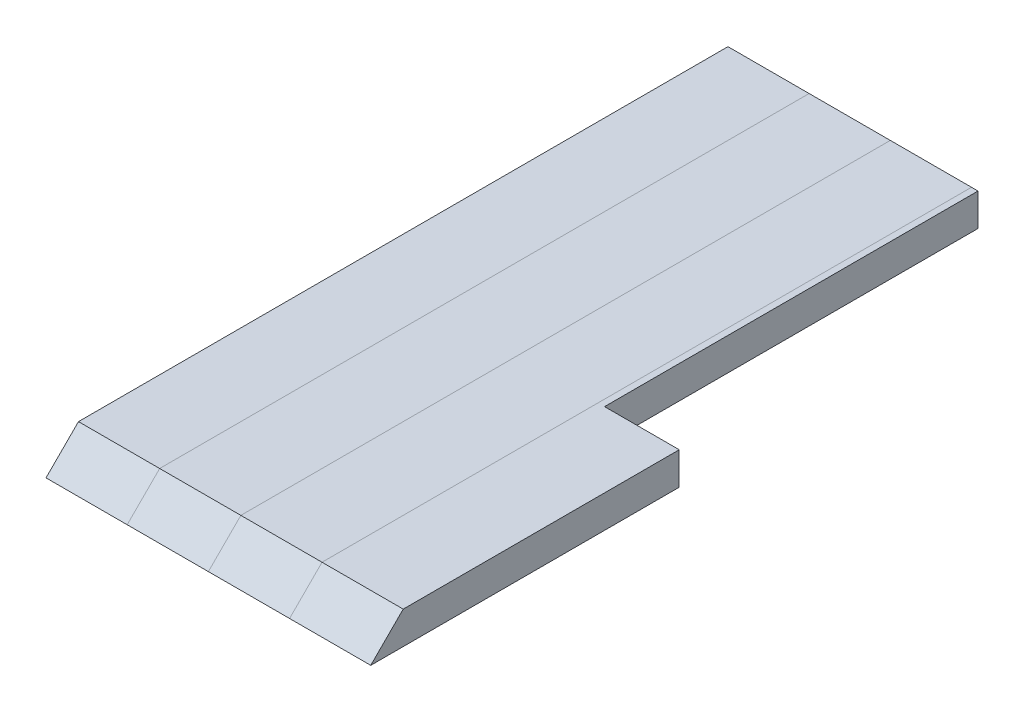
ISO-10303-21;
HEADER;
FILE_DESCRIPTION(('STEP AP214'),'2;1');
FILE_NAME('part.step','',(''),(''),'','','');
FILE_SCHEMA(('AUTOMOTIVE_DESIGN { 1 0 10303 214 1 1 1 1 }'));
ENDSEC;
DATA;
#1=APPLICATION_CONTEXT('core data for automotive mechanical design processes');
#2=APPLICATION_PROTOCOL_DEFINITION('international standard','automotive_design',2000,#1);
#3=PRODUCT_CONTEXT('',#1,'mechanical');
#4=PRODUCT('Part','Part','',(#3));
#5=PRODUCT_RELATED_PRODUCT_CATEGORY('part','',(#4));
#6=PRODUCT_DEFINITION_FORMATION('','',#4);
#7=PRODUCT_DEFINITION_CONTEXT('part definition',#1,'design');
#8=PRODUCT_DEFINITION('design','',#6,#7);
#9=PRODUCT_DEFINITION_SHAPE('','',#8);
#10=(LENGTH_UNIT() NAMED_UNIT(*) SI_UNIT(.MILLI.,.METRE.));
#11=(NAMED_UNIT(*) PLANE_ANGLE_UNIT() SI_UNIT($,.RADIAN.));
#12=(NAMED_UNIT(*) SI_UNIT($,.STERADIAN.) SOLID_ANGLE_UNIT());
#13=UNCERTAINTY_MEASURE_WITH_UNIT(LENGTH_MEASURE(1.E-05),#10,'distance_accuracy_value','');
#14=(GEOMETRIC_REPRESENTATION_CONTEXT(3) GLOBAL_UNCERTAINTY_ASSIGNED_CONTEXT((#13)) GLOBAL_UNIT_ASSIGNED_CONTEXT((#10,
#11,#12)) REPRESENTATION_CONTEXT('',''));
#15=CARTESIAN_POINT('',(0.,0.,0.));
#16=DIRECTION('',(0.,0.,1.));
#17=DIRECTION('',(1.,0.,0.));
#18=AXIS2_PLACEMENT_3D('',#15,#16,#17);
#19=CARTESIAN_POINT('',(0.,0.,0.));
#20=DIRECTION('',(0.,1.,0.));
#21=DIRECTION('',(0.,0.,1.));
#22=AXIS2_PLACEMENT_3D('',#19,#20,#21);
#23=PLANE('',#22);
#24=DIRECTION('',(1.,0.,0.));
#25=VECTOR('',#24,1.);
#26=CARTESIAN_POINT('',(12.5,0.,-105.));
#27=LINE('',#26,#25);
#28=CARTESIAN_POINT('',(12.5,0.,-105.));
#29=VERTEX_POINT('',#28);
#30=CARTESIAN_POINT('',(-12.5,0.,-105.));
#31=VERTEX_POINT('',#30);
#32=EDGE_CURVE('P0_E55',#29,#31,#27,.F.);
#33=ORIENTED_EDGE('',*,*,#32,.T.);
#34=DIRECTION('',(0.,0.,-1.));
#35=VECTOR('',#34,1.);
#36=CARTESIAN_POINT('',(-12.5,0.,-105.));
#37=LINE('',#36,#35);
#38=CARTESIAN_POINT('',(-12.5,0.,95.));
#39=VERTEX_POINT('',#38);
#40=EDGE_CURVE('P0_E76',#31,#39,#37,.F.);
#41=ORIENTED_EDGE('',*,*,#40,.T.);
#42=DIRECTION('',(1.,0.,0.));
#43=VECTOR('',#42,1.);
#44=CARTESIAN_POINT('',(-12.5,0.,95.));
#45=LINE('',#44,#43);
#46=CARTESIAN_POINT('',(12.5,0.,95.));
#47=VERTEX_POINT('',#46);
#48=EDGE_CURVE('P0_E58',#47,#39,#45,.F.);
#49=ORIENTED_EDGE('',*,*,#48,.F.);
#50=DIRECTION('',(0.,0.,1.));
#51=VECTOR('',#50,1.);
#52=CARTESIAN_POINT('',(12.5,0.,105.));
#53=LINE('',#52,#51);
#54=EDGE_CURVE('P0_E20',#47,#29,#53,.F.);
#55=ORIENTED_EDGE('',*,*,#54,.T.);
#56=EDGE_LOOP('',(#33,#41,#49,#55));
#57=FACE_BOUND('',#56,.T.);
#58=ADVANCED_FACE('P0_F17',(#57),#23,.T.);
#59=CARTESIAN_POINT('',(12.5,0.,105.));
#60=DIRECTION('',(-1.,0.,0.));
#61=DIRECTION('',(0.,0.,1.));
#62=AXIS2_PLACEMENT_3D('',#59,#60,#61);
#63=PLANE('',#62);
#64=DIRECTION('',(0.,0.,1.));
#65=VECTOR('',#64,1.);
#66=CARTESIAN_POINT('',(12.5,-10.,0.));
#67=LINE('',#66,#65);
#68=CARTESIAN_POINT('',(12.5,-10.,105.));
#69=VERTEX_POINT('',#68);
#70=CARTESIAN_POINT('',(12.5,-10.,-105.));
#71=VERTEX_POINT('',#70);
#72=EDGE_CURVE('P0_E73',#69,#71,#67,.F.);
#73=ORIENTED_EDGE('',*,*,#72,.T.);
#74=DIRECTION('',(0.,1.,0.));
#75=VECTOR('',#74,1.);
#76=CARTESIAN_POINT('',(12.5,0.,-105.));
#77=LINE('',#76,#75);
#78=EDGE_CURVE('P0_E63',#71,#29,#77,.T.);
#79=ORIENTED_EDGE('',*,*,#78,.T.);
#80=ORIENTED_EDGE('',*,*,#54,.F.);
#81=DIRECTION('',(0.,-0.707106781186548,0.707106781186548));
#82=VECTOR('',#81,1.);
#83=CARTESIAN_POINT('',(12.5,0.,95.));
#84=LINE('',#83,#82);
#85=EDGE_CURVE('P0_E78',#69,#47,#84,.F.);
#86=ORIENTED_EDGE('',*,*,#85,.F.);
#87=EDGE_LOOP('',(#73,#79,#80,#86));
#88=FACE_BOUND('',#87,.T.);
#89=ADVANCED_FACE('P0_F72',(#88),#63,.F.);
#90=CARTESIAN_POINT('',(12.5,0.,-105.));
#91=DIRECTION('',(0.,0.,1.));
#92=DIRECTION('',(1.,0.,0.));
#93=AXIS2_PLACEMENT_3D('',#90,#91,#92);
#94=PLANE('',#93);
#95=ORIENTED_EDGE('',*,*,#78,.F.);
#96=DIRECTION('',(1.,0.,0.));
#97=VECTOR('',#96,1.);
#98=CARTESIAN_POINT('',(0.,-10.,-105.));
#99=LINE('',#98,#97);
#100=CARTESIAN_POINT('',(-12.5,-10.,-105.));
#101=VERTEX_POINT('',#100);
#102=EDGE_CURVE('P0_E83',#71,#101,#99,.F.);
#103=ORIENTED_EDGE('',*,*,#102,.T.);
#104=DIRECTION('',(0.,1.,0.));
#105=VECTOR('',#104,1.);
#106=CARTESIAN_POINT('',(-12.5,0.,-105.));
#107=LINE('',#106,#105);
#108=EDGE_CURVE('P0_E69',#101,#31,#107,.T.);
#109=ORIENTED_EDGE('',*,*,#108,.T.);
#110=ORIENTED_EDGE('',*,*,#32,.F.);
#111=EDGE_LOOP('',(#95,#103,#109,#110));
#112=FACE_BOUND('',#111,.T.);
#113=ADVANCED_FACE('P0_F66',(#112),#94,.F.);
#114=CARTESIAN_POINT('',(-12.5,0.,-105.));
#115=DIRECTION('',(1.,0.,0.));
#116=DIRECTION('',(0.,0.,-1.));
#117=AXIS2_PLACEMENT_3D('',#114,#115,#116);
#118=PLANE('',#117);
#119=ORIENTED_EDGE('',*,*,#40,.F.);
#120=ORIENTED_EDGE('',*,*,#108,.F.);
#121=DIRECTION('',(0.,0.,1.));
#122=VECTOR('',#121,1.);
#123=CARTESIAN_POINT('',(-12.5,-10.,0.));
#124=LINE('',#123,#122);
#125=CARTESIAN_POINT('',(-12.5,-9.99999999999999,105.));
#126=VERTEX_POINT('',#125);
#127=EDGE_CURVE('P0_E26',#101,#126,#124,.T.);
#128=ORIENTED_EDGE('',*,*,#127,.T.);
#129=DIRECTION('',(0.,-0.707106781186548,0.707106781186548));
#130=VECTOR('',#129,1.);
#131=CARTESIAN_POINT('',(-12.5,0.,95.));
#132=LINE('',#131,#130);
#133=EDGE_CURVE('P0_E34',#39,#126,#132,.T.);
#134=ORIENTED_EDGE('',*,*,#133,.F.);
#135=EDGE_LOOP('',(#119,#120,#128,#134));
#136=FACE_BOUND('',#135,.T.);
#137=ADVANCED_FACE('P0_F88',(#136),#118,.F.);
#138=CARTESIAN_POINT('',(-12.5,0.,95.));
#139=DIRECTION('',(0.,0.707106781186548,0.707106781186548));
#140=DIRECTION('',(0.,-0.707106781186548,0.707106781186548));
#141=AXIS2_PLACEMENT_3D('',#138,#139,#140);
#142=PLANE('',#141);
#143=ORIENTED_EDGE('',*,*,#133,.T.);
#144=DIRECTION('',(1.,0.,0.));
#145=VECTOR('',#144,1.);
#146=CARTESIAN_POINT('',(0.,-10.,105.));
#147=LINE('',#146,#145);
#148=EDGE_CURVE('P0_E11',#126,#69,#147,.T.);
#149=ORIENTED_EDGE('',*,*,#148,.T.);
#150=ORIENTED_EDGE('',*,*,#85,.T.);
#151=ORIENTED_EDGE('',*,*,#48,.T.);
#152=EDGE_LOOP('',(#143,#149,#150,#151));
#153=FACE_BOUND('',#152,.T.);
#154=ADVANCED_FACE('P0_F91',(#153),#142,.T.);
#155=CARTESIAN_POINT('',(0.,-10.,0.));
#156=DIRECTION('',(0.,1.,0.));
#157=DIRECTION('',(0.,0.,1.));
#158=AXIS2_PLACEMENT_3D('',#155,#156,#157);
#159=PLANE('',#158);
#160=ORIENTED_EDGE('',*,*,#127,.F.);
#161=ORIENTED_EDGE('',*,*,#102,.F.);
#162=ORIENTED_EDGE('',*,*,#72,.F.);
#163=ORIENTED_EDGE('',*,*,#148,.F.);
#164=EDGE_LOOP('',(#160,#161,#162,#163));
#165=FACE_BOUND('',#164,.T.);
#166=ADVANCED_FACE('P0_F90',(#165),#159,.F.);
#167=CLOSED_SHELL('',(#58,#89,#113,#137,#154,#166));
#168=MANIFOLD_SOLID_BREP('P0_B1',#167);
#169=CARTESIAN_POINT('',(75.,0.,0.));
#170=DIRECTION('',(0.,1.,0.));
#171=DIRECTION('',(0.,0.,1.));
#172=AXIS2_PLACEMENT_3D('',#169,#170,#171);
#173=PLANE('',#172);
#174=DIRECTION('',(0.,0.,1.));
#175=VECTOR('',#174,1.);
#176=CARTESIAN_POINT('',(87.5,0.,105.));
#177=LINE('',#176,#175);
#178=CARTESIAN_POINT('',(87.5000000000001,0.,95.));
#179=VERTEX_POINT('',#178);
#180=CARTESIAN_POINT('',(87.5,0.,10.));
#181=VERTEX_POINT('',#180);
#182=EDGE_CURVE('P1_E95',#179,#181,#177,.F.);
#183=ORIENTED_EDGE('',*,*,#182,.T.);
#184=DIRECTION('',(-1.,0.,0.));
#185=VECTOR('',#184,1.);
#186=CARTESIAN_POINT('',(64.5,0.,10.));
#187=LINE('',#186,#185);
#188=CARTESIAN_POINT('',(64.5,0.,10.));
#189=VERTEX_POINT('',#188);
#190=EDGE_CURVE('P1_E97',#189,#181,#187,.F.);
#191=ORIENTED_EDGE('',*,*,#190,.F.);
#192=DIRECTION('',(0.,0.,-1.));
#193=VECTOR('',#192,1.);
#194=CARTESIAN_POINT('',(64.5,0.,-105.));
#195=LINE('',#194,#193);
#196=CARTESIAN_POINT('',(64.5,0.,-105.));
#197=VERTEX_POINT('',#196);
#198=EDGE_CURVE('P1_E75',#197,#189,#195,.F.);
#199=ORIENTED_EDGE('',*,*,#198,.F.);
#200=DIRECTION('',(1.,0.,0.));
#201=VECTOR('',#200,1.);
#202=CARTESIAN_POINT('',(87.5,0.,-105.));
#203=LINE('',#202,#201);
#204=CARTESIAN_POINT('',(62.5,0.,-105.));
#205=VERTEX_POINT('',#204);
#206=EDGE_CURVE('P1_E20',#197,#205,#203,.F.);
#207=ORIENTED_EDGE('',*,*,#206,.T.);
#208=DIRECTION('',(0.,0.,-1.));
#209=VECTOR('',#208,1.);
#210=CARTESIAN_POINT('',(62.5,0.,-105.));
#211=LINE('',#210,#209);
#212=CARTESIAN_POINT('',(62.5,0.,95.));
#213=VERTEX_POINT('',#212);
#214=EDGE_CURVE('P1_E72',#205,#213,#211,.F.);
#215=ORIENTED_EDGE('',*,*,#214,.T.);
#216=DIRECTION('',(1.,0.,0.));
#217=VECTOR('',#216,1.);
#218=CARTESIAN_POINT('',(-12.5,0.,95.));
#219=LINE('',#218,#217);
#220=EDGE_CURVE('P1_E65',#179,#213,#219,.F.);
#221=ORIENTED_EDGE('',*,*,#220,.F.);
#222=EDGE_LOOP('',(#183,#191,#199,#207,#215,#221));
#223=FACE_BOUND('',#222,.T.);
#224=ADVANCED_FACE('P1_F17',(#223),#173,.T.);
#225=CARTESIAN_POINT('',(87.5,0.,-105.));
#226=DIRECTION('',(0.,0.,1.));
#227=DIRECTION('',(1.,0.,0.));
#228=AXIS2_PLACEMENT_3D('',#225,#226,#227);
#229=PLANE('',#228);
#230=DIRECTION('',(1.,0.,0.));
#231=VECTOR('',#230,1.);
#232=CARTESIAN_POINT('',(75.,-10.,-105.));
#233=LINE('',#232,#231);
#234=CARTESIAN_POINT('',(64.5,-10.,-105.));
#235=VERTEX_POINT('',#234);
#236=CARTESIAN_POINT('',(62.5,-10.,-105.));
#237=VERTEX_POINT('',#236);
#238=EDGE_CURVE('P1_E89',#235,#237,#233,.F.);
#239=ORIENTED_EDGE('',*,*,#238,.T.);
#240=DIRECTION('',(0.,1.,0.));
#241=VECTOR('',#240,1.);
#242=CARTESIAN_POINT('',(62.5,0.,-105.));
#243=LINE('',#242,#241);
#244=EDGE_CURVE('P1_E80',#237,#205,#243,.T.);
#245=ORIENTED_EDGE('',*,*,#244,.T.);
#246=ORIENTED_EDGE('',*,*,#206,.F.);
#247=DIRECTION('',(0.,1.,0.));
#248=VECTOR('',#247,1.);
#249=CARTESIAN_POINT('',(64.5,0.,-105.));
#250=LINE('',#249,#248);
#251=EDGE_CURVE('P1_E103',#235,#197,#250,.T.);
#252=ORIENTED_EDGE('',*,*,#251,.F.);
#253=EDGE_LOOP('',(#239,#245,#246,#252));
#254=FACE_BOUND('',#253,.T.);
#255=ADVANCED_FACE('P1_F88',(#254),#229,.F.);
#256=CARTESIAN_POINT('',(62.5,0.,-105.));
#257=DIRECTION('',(1.,0.,0.));
#258=DIRECTION('',(0.,0.,-1.));
#259=AXIS2_PLACEMENT_3D('',#256,#257,#258);
#260=PLANE('',#259);
#261=ORIENTED_EDGE('',*,*,#214,.F.);
#262=ORIENTED_EDGE('',*,*,#244,.F.);
#263=DIRECTION('',(0.,0.,1.));
#264=VECTOR('',#263,1.);
#265=CARTESIAN_POINT('',(62.5,-10.,0.));
#266=LINE('',#265,#264);
#267=CARTESIAN_POINT('',(62.5,-9.99999999999999,105.));
#268=VERTEX_POINT('',#267);
#269=EDGE_CURVE('P1_E106',#237,#268,#266,.T.);
#270=ORIENTED_EDGE('',*,*,#269,.T.);
#271=DIRECTION('',(0.,-0.707106781186548,0.707106781186548));
#272=VECTOR('',#271,1.);
#273=CARTESIAN_POINT('',(62.5,0.,95.));
#274=LINE('',#273,#272);
#275=EDGE_CURVE('P1_E85',#213,#268,#274,.T.);
#276=ORIENTED_EDGE('',*,*,#275,.F.);
#277=EDGE_LOOP('',(#261,#262,#270,#276));
#278=FACE_BOUND('',#277,.T.);
#279=ADVANCED_FACE('P1_F82',(#278),#260,.F.);
#280=CARTESIAN_POINT('',(-12.5,0.,95.));
#281=DIRECTION('',(0.,0.707106781186548,0.707106781186548));
#282=DIRECTION('',(0.,-0.707106781186548,0.707106781186548));
#283=AXIS2_PLACEMENT_3D('',#280,#281,#282);
#284=PLANE('',#283);
#285=ORIENTED_EDGE('',*,*,#275,.T.);
#286=DIRECTION('',(1.,0.,0.));
#287=VECTOR('',#286,1.);
#288=CARTESIAN_POINT('',(75.,-10.,105.));
#289=LINE('',#288,#287);
#290=CARTESIAN_POINT('',(87.5000000000001,-10.,105.));
#291=VERTEX_POINT('',#290);
#292=EDGE_CURVE('P1_E108',#268,#291,#289,.T.);
#293=ORIENTED_EDGE('',*,*,#292,.T.);
#294=DIRECTION('',(0.,0.707106781186548,-0.707106781186547));
#295=VECTOR('',#294,1.);
#296=CARTESIAN_POINT('',(87.5,-10.,105.));
#297=LINE('',#296,#295);
#298=EDGE_CURVE('P1_E93',#291,#179,#297,.T.);
#299=ORIENTED_EDGE('',*,*,#298,.T.);
#300=ORIENTED_EDGE('',*,*,#220,.T.);
#301=EDGE_LOOP('',(#285,#293,#299,#300));
#302=FACE_BOUND('',#301,.T.);
#303=ADVANCED_FACE('P1_F126',(#302),#284,.T.);
#304=CARTESIAN_POINT('',(87.5,0.,105.));
#305=DIRECTION('',(-1.,0.,0.));
#306=DIRECTION('',(0.,0.,1.));
#307=AXIS2_PLACEMENT_3D('',#304,#305,#306);
#308=PLANE('',#307);
#309=ORIENTED_EDGE('',*,*,#182,.F.);
#310=ORIENTED_EDGE('',*,*,#298,.F.);
#311=DIRECTION('',(0.,0.,1.));
#312=VECTOR('',#311,1.);
#313=CARTESIAN_POINT('',(87.5,-10.,0.));
#314=LINE('',#313,#312);
#315=CARTESIAN_POINT('',(87.5,-10.,10.));
#316=VERTEX_POINT('',#315);
#317=EDGE_CURVE('P1_E111',#291,#316,#314,.F.);
#318=ORIENTED_EDGE('',*,*,#317,.T.);
#319=DIRECTION('',(0.,1.,0.));
#320=VECTOR('',#319,1.);
#321=CARTESIAN_POINT('',(87.5,0.,10.));
#322=LINE('',#321,#320);
#323=EDGE_CURVE('P1_E99',#181,#316,#322,.F.);
#324=ORIENTED_EDGE('',*,*,#323,.F.);
#325=EDGE_LOOP('',(#309,#310,#318,#324));
#326=FACE_BOUND('',#325,.T.);
#327=ADVANCED_FACE('P1_F125',(#326),#308,.F.);
#328=CARTESIAN_POINT('',(64.5,0.,10.));
#329=DIRECTION('',(0.,0.,-1.));
#330=DIRECTION('',(-1.,0.,0.));
#331=AXIS2_PLACEMENT_3D('',#328,#329,#330);
#332=PLANE('',#331);
#333=DIRECTION('',(1.,0.,0.));
#334=VECTOR('',#333,1.);
#335=CARTESIAN_POINT('',(75.,-10.,10.));
#336=LINE('',#335,#334);
#337=CARTESIAN_POINT('',(64.5,-10.,10.));
#338=VERTEX_POINT('',#337);
#339=EDGE_CURVE('P1_E26',#316,#338,#336,.F.);
#340=ORIENTED_EDGE('',*,*,#339,.T.);
#341=DIRECTION('',(0.,1.,0.));
#342=VECTOR('',#341,1.);
#343=CARTESIAN_POINT('',(64.5,0.,9.99999999999999));
#344=LINE('',#343,#342);
#345=EDGE_CURVE('P1_E34',#189,#338,#344,.F.);
#346=ORIENTED_EDGE('',*,*,#345,.F.);
#347=ORIENTED_EDGE('',*,*,#190,.T.);
#348=ORIENTED_EDGE('',*,*,#323,.T.);
#349=EDGE_LOOP('',(#340,#346,#347,#348));
#350=FACE_BOUND('',#349,.T.);
#351=ADVANCED_FACE('P1_F117',(#350),#332,.T.);
#352=CARTESIAN_POINT('',(64.5,0.,-105.));
#353=DIRECTION('',(1.,0.,0.));
#354=DIRECTION('',(0.,0.,-1.));
#355=AXIS2_PLACEMENT_3D('',#352,#353,#354);
#356=PLANE('',#355);
#357=DIRECTION('',(0.,0.,1.));
#358=VECTOR('',#357,1.);
#359=CARTESIAN_POINT('',(64.5,-10.,0.));
#360=LINE('',#359,#358);
#361=EDGE_CURVE('P1_E11',#338,#235,#360,.F.);
#362=ORIENTED_EDGE('',*,*,#361,.T.);
#363=ORIENTED_EDGE('',*,*,#251,.T.);
#364=ORIENTED_EDGE('',*,*,#198,.T.);
#365=ORIENTED_EDGE('',*,*,#345,.T.);
#366=EDGE_LOOP('',(#362,#363,#364,#365));
#367=FACE_BOUND('',#366,.T.);
#368=ADVANCED_FACE('P1_F127',(#367),#356,.T.);
#369=CARTESIAN_POINT('',(75.,-10.,0.));
#370=DIRECTION('',(0.,1.,0.));
#371=DIRECTION('',(0.,0.,1.));
#372=AXIS2_PLACEMENT_3D('',#369,#370,#371);
#373=PLANE('',#372);
#374=ORIENTED_EDGE('',*,*,#339,.F.);
#375=ORIENTED_EDGE('',*,*,#317,.F.);
#376=ORIENTED_EDGE('',*,*,#292,.F.);
#377=ORIENTED_EDGE('',*,*,#269,.F.);
#378=ORIENTED_EDGE('',*,*,#238,.F.);
#379=ORIENTED_EDGE('',*,*,#361,.F.);
#380=EDGE_LOOP('',(#374,#375,#376,#377,#378,#379));
#381=FACE_BOUND('',#380,.T.);
#382=ADVANCED_FACE('P1_F121',(#381),#373,.F.);
#383=CLOSED_SHELL('',(#224,#255,#279,#303,#327,#351,#368,#382));
#384=MANIFOLD_SOLID_BREP('P1_B1',#383);
#385=CARTESIAN_POINT('',(25.,0.,0.));
#386=DIRECTION('',(0.,1.,0.));
#387=DIRECTION('',(0.,0.,1.));
#388=AXIS2_PLACEMENT_3D('',#385,#386,#387);
#389=PLANE('',#388);
#390=DIRECTION('',(1.,0.,0.));
#391=VECTOR('',#390,1.);
#392=CARTESIAN_POINT('',(37.5,0.,-105.));
#393=LINE('',#392,#391);
#394=CARTESIAN_POINT('',(37.5,0.,-105.));
#395=VERTEX_POINT('',#394);
#396=CARTESIAN_POINT('',(12.5,0.,-105.));
#397=VERTEX_POINT('',#396);
#398=EDGE_CURVE('P2_E55',#395,#397,#393,.F.);
#399=ORIENTED_EDGE('',*,*,#398,.T.);
#400=DIRECTION('',(0.,0.,-1.));
#401=VECTOR('',#400,1.);
#402=CARTESIAN_POINT('',(12.5,0.,-105.));
#403=LINE('',#402,#401);
#404=CARTESIAN_POINT('',(12.5,0.,95.));
#405=VERTEX_POINT('',#404);
#406=EDGE_CURVE('P2_E76',#397,#405,#403,.F.);
#407=ORIENTED_EDGE('',*,*,#406,.T.);
#408=DIRECTION('',(1.,0.,0.));
#409=VECTOR('',#408,1.);
#410=CARTESIAN_POINT('',(-12.5,0.,95.));
#411=LINE('',#410,#409);
#412=CARTESIAN_POINT('',(37.5,0.,95.));
#413=VERTEX_POINT('',#412);
#414=EDGE_CURVE('P2_E58',#413,#405,#411,.F.);
#415=ORIENTED_EDGE('',*,*,#414,.F.);
#416=DIRECTION('',(0.,0.,1.));
#417=VECTOR('',#416,1.);
#418=CARTESIAN_POINT('',(37.5,0.,105.));
#419=LINE('',#418,#417);
#420=EDGE_CURVE('P2_E20',#413,#395,#419,.F.);
#421=ORIENTED_EDGE('',*,*,#420,.T.);
#422=EDGE_LOOP('',(#399,#407,#415,#421));
#423=FACE_BOUND('',#422,.T.);
#424=ADVANCED_FACE('P2_F17',(#423),#389,.T.);
#425=CARTESIAN_POINT('',(37.5,0.,105.));
#426=DIRECTION('',(-1.,0.,0.));
#427=DIRECTION('',(0.,0.,1.));
#428=AXIS2_PLACEMENT_3D('',#425,#426,#427);
#429=PLANE('',#428);
#430=DIRECTION('',(0.,0.,1.));
#431=VECTOR('',#430,1.);
#432=CARTESIAN_POINT('',(37.5,-10.,0.));
#433=LINE('',#432,#431);
#434=CARTESIAN_POINT('',(37.5,-10.,105.));
#435=VERTEX_POINT('',#434);
#436=CARTESIAN_POINT('',(37.5,-10.,-105.));
#437=VERTEX_POINT('',#436);
#438=EDGE_CURVE('P2_E73',#435,#437,#433,.F.);
#439=ORIENTED_EDGE('',*,*,#438,.T.);
#440=DIRECTION('',(0.,1.,0.));
#441=VECTOR('',#440,1.);
#442=CARTESIAN_POINT('',(37.5,0.,-105.));
#443=LINE('',#442,#441);
#444=EDGE_CURVE('P2_E63',#437,#395,#443,.T.);
#445=ORIENTED_EDGE('',*,*,#444,.T.);
#446=ORIENTED_EDGE('',*,*,#420,.F.);
#447=DIRECTION('',(0.,-0.707106781186548,0.707106781186548));
#448=VECTOR('',#447,1.);
#449=CARTESIAN_POINT('',(37.5,0.,95.));
#450=LINE('',#449,#448);
#451=EDGE_CURVE('P2_E79',#435,#413,#450,.F.);
#452=ORIENTED_EDGE('',*,*,#451,.F.);
#453=EDGE_LOOP('',(#439,#445,#446,#452));
#454=FACE_BOUND('',#453,.T.);
#455=ADVANCED_FACE('P2_F72',(#454),#429,.F.);
#456=CARTESIAN_POINT('',(37.5,0.,-105.));
#457=DIRECTION('',(0.,0.,1.));
#458=DIRECTION('',(1.,0.,0.));
#459=AXIS2_PLACEMENT_3D('',#456,#457,#458);
#460=PLANE('',#459);
#461=ORIENTED_EDGE('',*,*,#444,.F.);
#462=DIRECTION('',(1.,0.,0.));
#463=VECTOR('',#462,1.);
#464=CARTESIAN_POINT('',(25.,-10.,-105.));
#465=LINE('',#464,#463);
#466=CARTESIAN_POINT('',(12.5,-10.,-105.));
#467=VERTEX_POINT('',#466);
#468=EDGE_CURVE('P2_E83',#437,#467,#465,.F.);
#469=ORIENTED_EDGE('',*,*,#468,.T.);
#470=DIRECTION('',(0.,1.,0.));
#471=VECTOR('',#470,1.);
#472=CARTESIAN_POINT('',(12.5,0.,-105.));
#473=LINE('',#472,#471);
#474=EDGE_CURVE('P2_E69',#467,#397,#473,.T.);
#475=ORIENTED_EDGE('',*,*,#474,.T.);
#476=ORIENTED_EDGE('',*,*,#398,.F.);
#477=EDGE_LOOP('',(#461,#469,#475,#476));
#478=FACE_BOUND('',#477,.T.);
#479=ADVANCED_FACE('P2_F66',(#478),#460,.F.);
#480=CARTESIAN_POINT('',(12.5,0.,-105.));
#481=DIRECTION('',(1.,0.,0.));
#482=DIRECTION('',(0.,0.,-1.));
#483=AXIS2_PLACEMENT_3D('',#480,#481,#482);
#484=PLANE('',#483);
#485=ORIENTED_EDGE('',*,*,#406,.F.);
#486=ORIENTED_EDGE('',*,*,#474,.F.);
#487=DIRECTION('',(0.,0.,1.));
#488=VECTOR('',#487,1.);
#489=CARTESIAN_POINT('',(12.5,-10.,0.));
#490=LINE('',#489,#488);
#491=CARTESIAN_POINT('',(12.5,-9.99999999999999,105.));
#492=VERTEX_POINT('',#491);
#493=EDGE_CURVE('P2_E26',#467,#492,#490,.T.);
#494=ORIENTED_EDGE('',*,*,#493,.T.);
#495=DIRECTION('',(0.,-0.707106781186548,0.707106781186548));
#496=VECTOR('',#495,1.);
#497=CARTESIAN_POINT('',(12.5,0.,95.));
#498=LINE('',#497,#496);
#499=EDGE_CURVE('P2_E34',#405,#492,#498,.T.);
#500=ORIENTED_EDGE('',*,*,#499,.F.);
#501=EDGE_LOOP('',(#485,#486,#494,#500));
#502=FACE_BOUND('',#501,.T.);
#503=ADVANCED_FACE('P2_F88',(#502),#484,.F.);
#504=CARTESIAN_POINT('',(-12.5,0.,95.));
#505=DIRECTION('',(0.,0.707106781186548,0.707106781186548));
#506=DIRECTION('',(0.,-0.707106781186548,0.707106781186548));
#507=AXIS2_PLACEMENT_3D('',#504,#505,#506);
#508=PLANE('',#507);
#509=ORIENTED_EDGE('',*,*,#451,.T.);
#510=ORIENTED_EDGE('',*,*,#414,.T.);
#511=ORIENTED_EDGE('',*,*,#499,.T.);
#512=DIRECTION('',(1.,0.,0.));
#513=VECTOR('',#512,1.);
#514=CARTESIAN_POINT('',(25.,-10.,105.));
#515=LINE('',#514,#513);
#516=EDGE_CURVE('P2_E11',#492,#435,#515,.T.);
#517=ORIENTED_EDGE('',*,*,#516,.T.);
#518=EDGE_LOOP('',(#509,#510,#511,#517));
#519=FACE_BOUND('',#518,.T.);
#520=ADVANCED_FACE('P2_F91',(#519),#508,.T.);
#521=CARTESIAN_POINT('',(25.,-10.,0.));
#522=DIRECTION('',(0.,1.,0.));
#523=DIRECTION('',(0.,0.,1.));
#524=AXIS2_PLACEMENT_3D('',#521,#522,#523);
#525=PLANE('',#524);
#526=ORIENTED_EDGE('',*,*,#493,.F.);
#527=ORIENTED_EDGE('',*,*,#468,.F.);
#528=ORIENTED_EDGE('',*,*,#438,.F.);
#529=ORIENTED_EDGE('',*,*,#516,.F.);
#530=EDGE_LOOP('',(#526,#527,#528,#529));
#531=FACE_BOUND('',#530,.T.);
#532=ADVANCED_FACE('P2_F90',(#531),#525,.F.);
#533=CLOSED_SHELL('',(#424,#455,#479,#503,#520,#532));
#534=MANIFOLD_SOLID_BREP('P2_B1',#533);
#535=CARTESIAN_POINT('',(50.,0.,0.));
#536=DIRECTION('',(0.,1.,0.));
#537=DIRECTION('',(0.,0.,1.));
#538=AXIS2_PLACEMENT_3D('',#535,#536,#537);
#539=PLANE('',#538);
#540=DIRECTION('',(1.,0.,0.));
#541=VECTOR('',#540,1.);
#542=CARTESIAN_POINT('',(62.5,0.,-105.));
#543=LINE('',#542,#541);
#544=CARTESIAN_POINT('',(62.5,0.,-105.));
#545=VERTEX_POINT('',#544);
#546=CARTESIAN_POINT('',(37.5,0.,-105.));
#547=VERTEX_POINT('',#546);
#548=EDGE_CURVE('P3_E55',#545,#547,#543,.F.);
#549=ORIENTED_EDGE('',*,*,#548,.T.);
#550=DIRECTION('',(0.,0.,-1.));
#551=VECTOR('',#550,1.);
#552=CARTESIAN_POINT('',(37.5,0.,-105.));
#553=LINE('',#552,#551);
#554=CARTESIAN_POINT('',(37.5,0.,95.));
#555=VERTEX_POINT('',#554);
#556=EDGE_CURVE('P3_E76',#547,#555,#553,.F.);
#557=ORIENTED_EDGE('',*,*,#556,.T.);
#558=DIRECTION('',(1.,0.,0.));
#559=VECTOR('',#558,1.);
#560=CARTESIAN_POINT('',(-12.5,0.,95.));
#561=LINE('',#560,#559);
#562=CARTESIAN_POINT('',(62.5,0.,95.));
#563=VERTEX_POINT('',#562);
#564=EDGE_CURVE('P3_E58',#563,#555,#561,.F.);
#565=ORIENTED_EDGE('',*,*,#564,.F.);
#566=DIRECTION('',(0.,0.,1.));
#567=VECTOR('',#566,1.);
#568=CARTESIAN_POINT('',(62.5,0.,105.));
#569=LINE('',#568,#567);
#570=EDGE_CURVE('P3_E20',#563,#545,#569,.F.);
#571=ORIENTED_EDGE('',*,*,#570,.T.);
#572=EDGE_LOOP('',(#549,#557,#565,#571));
#573=FACE_BOUND('',#572,.T.);
#574=ADVANCED_FACE('P3_F17',(#573),#539,.T.);
#575=CARTESIAN_POINT('',(62.5,0.,105.));
#576=DIRECTION('',(-1.,0.,0.));
#577=DIRECTION('',(0.,0.,1.));
#578=AXIS2_PLACEMENT_3D('',#575,#576,#577);
#579=PLANE('',#578);
#580=DIRECTION('',(0.,0.,1.));
#581=VECTOR('',#580,1.);
#582=CARTESIAN_POINT('',(62.5,-10.,0.));
#583=LINE('',#582,#581);
#584=CARTESIAN_POINT('',(62.5,-10.,105.));
#585=VERTEX_POINT('',#584);
#586=CARTESIAN_POINT('',(62.5,-10.,-105.));
#587=VERTEX_POINT('',#586);
#588=EDGE_CURVE('P3_E73',#585,#587,#583,.F.);
#589=ORIENTED_EDGE('',*,*,#588,.T.);
#590=DIRECTION('',(0.,1.,0.));
#591=VECTOR('',#590,1.);
#592=CARTESIAN_POINT('',(62.5,0.,-105.));
#593=LINE('',#592,#591);
#594=EDGE_CURVE('P3_E63',#587,#545,#593,.T.);
#595=ORIENTED_EDGE('',*,*,#594,.T.);
#596=ORIENTED_EDGE('',*,*,#570,.F.);
#597=DIRECTION('',(0.,-0.707106781186548,0.707106781186548));
#598=VECTOR('',#597,1.);
#599=CARTESIAN_POINT('',(62.5,0.,95.));
#600=LINE('',#599,#598);
#601=EDGE_CURVE('P3_E79',#585,#563,#600,.F.);
#602=ORIENTED_EDGE('',*,*,#601,.F.);
#603=EDGE_LOOP('',(#589,#595,#596,#602));
#604=FACE_BOUND('',#603,.T.);
#605=ADVANCED_FACE('P3_F72',(#604),#579,.F.);
#606=CARTESIAN_POINT('',(62.5,0.,-105.));
#607=DIRECTION('',(0.,0.,1.));
#608=DIRECTION('',(1.,0.,0.));
#609=AXIS2_PLACEMENT_3D('',#606,#607,#608);
#610=PLANE('',#609);
#611=ORIENTED_EDGE('',*,*,#594,.F.);
#612=DIRECTION('',(1.,0.,0.));
#613=VECTOR('',#612,1.);
#614=CARTESIAN_POINT('',(50.,-10.,-105.));
#615=LINE('',#614,#613);
#616=CARTESIAN_POINT('',(37.5,-10.,-105.));
#617=VERTEX_POINT('',#616);
#618=EDGE_CURVE('P3_E83',#587,#617,#615,.F.);
#619=ORIENTED_EDGE('',*,*,#618,.T.);
#620=DIRECTION('',(0.,1.,0.));
#621=VECTOR('',#620,1.);
#622=CARTESIAN_POINT('',(37.5,0.,-105.));
#623=LINE('',#622,#621);
#624=EDGE_CURVE('P3_E69',#617,#547,#623,.T.);
#625=ORIENTED_EDGE('',*,*,#624,.T.);
#626=ORIENTED_EDGE('',*,*,#548,.F.);
#627=EDGE_LOOP('',(#611,#619,#625,#626));
#628=FACE_BOUND('',#627,.T.);
#629=ADVANCED_FACE('P3_F66',(#628),#610,.F.);
#630=CARTESIAN_POINT('',(37.5,0.,-105.));
#631=DIRECTION('',(1.,0.,0.));
#632=DIRECTION('',(0.,0.,-1.));
#633=AXIS2_PLACEMENT_3D('',#630,#631,#632);
#634=PLANE('',#633);
#635=ORIENTED_EDGE('',*,*,#556,.F.);
#636=ORIENTED_EDGE('',*,*,#624,.F.);
#637=DIRECTION('',(0.,0.,1.));
#638=VECTOR('',#637,1.);
#639=CARTESIAN_POINT('',(37.5,-10.,0.));
#640=LINE('',#639,#638);
#641=CARTESIAN_POINT('',(37.5,-9.99999999999999,105.));
#642=VERTEX_POINT('',#641);
#643=EDGE_CURVE('P3_E26',#617,#642,#640,.T.);
#644=ORIENTED_EDGE('',*,*,#643,.T.);
#645=DIRECTION('',(0.,-0.707106781186548,0.707106781186548));
#646=VECTOR('',#645,1.);
#647=CARTESIAN_POINT('',(37.5,0.,95.));
#648=LINE('',#647,#646);
#649=EDGE_CURVE('P3_E34',#555,#642,#648,.T.);
#650=ORIENTED_EDGE('',*,*,#649,.F.);
#651=EDGE_LOOP('',(#635,#636,#644,#650));
#652=FACE_BOUND('',#651,.T.);
#653=ADVANCED_FACE('P3_F88',(#652),#634,.F.);
#654=CARTESIAN_POINT('',(-12.5,0.,95.));
#655=DIRECTION('',(0.,0.707106781186548,0.707106781186548));
#656=DIRECTION('',(0.,-0.707106781186548,0.707106781186548));
#657=AXIS2_PLACEMENT_3D('',#654,#655,#656);
#658=PLANE('',#657);
#659=ORIENTED_EDGE('',*,*,#601,.T.);
#660=ORIENTED_EDGE('',*,*,#564,.T.);
#661=ORIENTED_EDGE('',*,*,#649,.T.);
#662=DIRECTION('',(1.,0.,0.));
#663=VECTOR('',#662,1.);
#664=CARTESIAN_POINT('',(50.,-10.,105.));
#665=LINE('',#664,#663);
#666=EDGE_CURVE('P3_E11',#642,#585,#665,.T.);
#667=ORIENTED_EDGE('',*,*,#666,.T.);
#668=EDGE_LOOP('',(#659,#660,#661,#667));
#669=FACE_BOUND('',#668,.T.);
#670=ADVANCED_FACE('P3_F91',(#669),#658,.T.);
#671=CARTESIAN_POINT('',(50.,-10.,0.));
#672=DIRECTION('',(0.,1.,0.));
#673=DIRECTION('',(0.,0.,1.));
#674=AXIS2_PLACEMENT_3D('',#671,#672,#673);
#675=PLANE('',#674);
#676=ORIENTED_EDGE('',*,*,#643,.F.);
#677=ORIENTED_EDGE('',*,*,#618,.F.);
#678=ORIENTED_EDGE('',*,*,#588,.F.);
#679=ORIENTED_EDGE('',*,*,#666,.F.);
#680=EDGE_LOOP('',(#676,#677,#678,#679));
#681=FACE_BOUND('',#680,.T.);
#682=ADVANCED_FACE('P3_F90',(#681),#675,.F.);
#683=CLOSED_SHELL('',(#574,#605,#629,#653,#670,#682));
#684=MANIFOLD_SOLID_BREP('P3_B1',#683);
#685=ADVANCED_BREP_SHAPE_REPRESENTATION('',(#18,#168,#384,#534,#684),#14);
#686=SHAPE_DEFINITION_REPRESENTATION(#9,#685);
ENDSEC;
END-ISO-10303-21;
